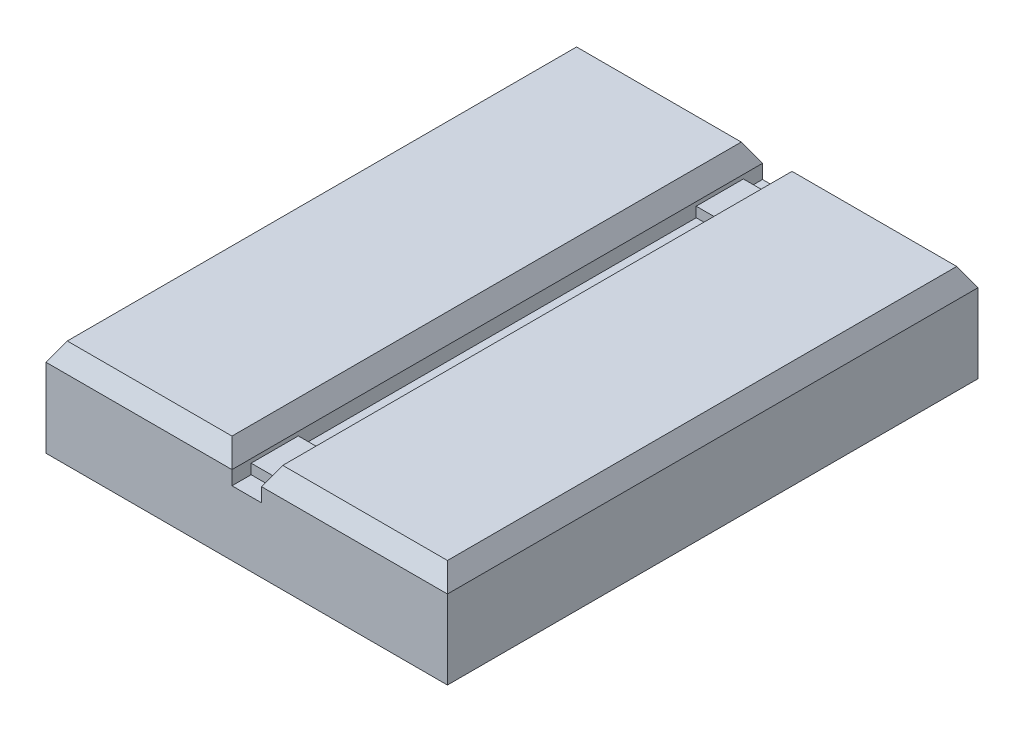
ISO-10303-21;
HEADER;
FILE_DESCRIPTION(('STEP AP214'),'2;1');
FILE_NAME('part.step','',(''),(''),'','','');
FILE_SCHEMA(('AUTOMOTIVE_DESIGN { 1 0 10303 214 1 1 1 1 }'));
ENDSEC;
DATA;
#1=APPLICATION_CONTEXT('core data for automotive mechanical design processes');
#2=APPLICATION_PROTOCOL_DEFINITION('international standard','automotive_design',2000,#1);
#3=PRODUCT_CONTEXT('',#1,'mechanical');
#4=PRODUCT('Part','Part','',(#3));
#5=PRODUCT_RELATED_PRODUCT_CATEGORY('part','',(#4));
#6=PRODUCT_DEFINITION_FORMATION('','',#4);
#7=PRODUCT_DEFINITION_CONTEXT('part definition',#1,'design');
#8=PRODUCT_DEFINITION('design','',#6,#7);
#9=PRODUCT_DEFINITION_SHAPE('','',#8);
#10=(LENGTH_UNIT() NAMED_UNIT(*) SI_UNIT(.MILLI.,.METRE.));
#11=(NAMED_UNIT(*) PLANE_ANGLE_UNIT() SI_UNIT($,.RADIAN.));
#12=(NAMED_UNIT(*) SI_UNIT($,.STERADIAN.) SOLID_ANGLE_UNIT());
#13=UNCERTAINTY_MEASURE_WITH_UNIT(LENGTH_MEASURE(1.E-05),#10,'distance_accuracy_value','');
#14=(GEOMETRIC_REPRESENTATION_CONTEXT(3) GLOBAL_UNCERTAINTY_ASSIGNED_CONTEXT((#13)) GLOBAL_UNIT_ASSIGNED_CONTEXT((#10,
#11,#12)) REPRESENTATION_CONTEXT('',''));
#15=CARTESIAN_POINT('',(0.,0.,0.));
#16=DIRECTION('',(0.,0.,1.));
#17=DIRECTION('',(1.,0.,0.));
#18=AXIS2_PLACEMENT_3D('',#15,#16,#17);
#19=CARTESIAN_POINT('',(1.27,8.382,22.86));
#20=DIRECTION('',(1.,0.,0.));
#21=DIRECTION('',(0.,1.,0.));
#22=AXIS2_PLACEMENT_3D('',#19,#20,#21);
#23=PLANE('',#22);
#24=DIRECTION('',(0.,1.,0.));
#25=VECTOR('',#24,1.);
#26=CARTESIAN_POINT('',(1.27,6.4516,-21.209));
#27=LINE('',#26,#25);
#28=CARTESIAN_POINT('',(1.27,5.588,-21.209));
#29=VERTEX_POINT('',#28);
#30=CARTESIAN_POINT('',(1.27,6.4516,-21.209));
#31=VERTEX_POINT('',#30);
#32=EDGE_CURVE('E189',#29,#31,#27,.T.);
#33=ORIENTED_EDGE('',*,*,#32,.T.);
#34=DIRECTION('',(0.,0.,1.));
#35=VECTOR('',#34,1.);
#36=CARTESIAN_POINT('',(1.27,6.4516,-21.209));
#37=LINE('',#36,#35);
#38=CARTESIAN_POINT('',(1.27,6.4516,-17.145));
#39=VERTEX_POINT('',#38);
#40=EDGE_CURVE('E188',#31,#39,#37,.T.);
#41=ORIENTED_EDGE('',*,*,#40,.T.);
#42=DIRECTION('',(0.,1.,0.));
#43=VECTOR('',#42,1.);
#44=CARTESIAN_POINT('',(1.27,6.4516,-17.145));
#45=LINE('',#44,#43);
#46=CARTESIAN_POINT('',(1.27,5.588,-17.145));
#47=VERTEX_POINT('',#46);
#48=EDGE_CURVE('E552',#47,#39,#45,.T.);
#49=ORIENTED_EDGE('',*,*,#48,.F.);
#50=DIRECTION('',(0.,0.,-1.));
#51=VECTOR('',#50,1.);
#52=CARTESIAN_POINT('',(1.27,5.588,22.86));
#53=LINE('',#52,#51);
#54=CARTESIAN_POINT('',(1.27,5.588,17.145));
#55=VERTEX_POINT('',#54);
#56=EDGE_CURVE('E266',#55,#47,#53,.T.);
#57=ORIENTED_EDGE('',*,*,#56,.F.);
#58=DIRECTION('',(0.,1.,0.));
#59=VECTOR('',#58,1.);
#60=CARTESIAN_POINT('',(1.27,6.4516,17.145));
#61=LINE('',#60,#59);
#62=CARTESIAN_POINT('',(1.27,6.4516,17.145));
#63=VERTEX_POINT('',#62);
#64=EDGE_CURVE('E210',#55,#63,#61,.T.);
#65=ORIENTED_EDGE('',*,*,#64,.T.);
#66=DIRECTION('',(0.,0.,-1.));
#67=VECTOR('',#66,1.);
#68=CARTESIAN_POINT('',(1.27,6.4516,21.209));
#69=LINE('',#68,#67);
#70=CARTESIAN_POINT('',(1.27,6.4516,21.209));
#71=VERTEX_POINT('',#70);
#72=EDGE_CURVE('E216',#71,#63,#69,.T.);
#73=ORIENTED_EDGE('',*,*,#72,.F.);
#74=DIRECTION('',(0.,1.,0.));
#75=VECTOR('',#74,1.);
#76=CARTESIAN_POINT('',(1.27,6.4516,21.209));
#77=LINE('',#76,#75);
#78=CARTESIAN_POINT('',(1.27,5.588,21.209));
#79=VERTEX_POINT('',#78);
#80=EDGE_CURVE('E204',#79,#71,#77,.T.);
#81=ORIENTED_EDGE('',*,*,#80,.F.);
#82=CARTESIAN_POINT('',(1.27,5.588,22.86));
#83=VERTEX_POINT('',#82);
#84=EDGE_CURVE('E262',#83,#79,#53,.T.);
#85=ORIENTED_EDGE('',*,*,#84,.F.);
#86=DIRECTION('',(0.,-1.,0.));
#87=VECTOR('',#86,1.);
#88=CARTESIAN_POINT('',(1.27,8.382,22.86));
#89=LINE('',#88,#87);
#90=CARTESIAN_POINT('',(1.27,6.79449999999999,22.86));
#91=VERTEX_POINT('',#90);
#92=EDGE_CURVE('E219',#91,#83,#89,.T.);
#93=ORIENTED_EDGE('',*,*,#92,.F.);
#94=DIRECTION('',(0.,0.,-1.));
#95=VECTOR('',#94,1.);
#96=CARTESIAN_POINT('',(1.27,6.79449999999999,22.86));
#97=LINE('',#96,#95);
#98=CARTESIAN_POINT('',(1.27,6.79449999999999,-22.86));
#99=VERTEX_POINT('',#98);
#100=EDGE_CURVE('E282',#91,#99,#97,.T.);
#101=ORIENTED_EDGE('',*,*,#100,.T.);
#102=DIRECTION('',(0.,-1.,0.));
#103=VECTOR('',#102,1.);
#104=CARTESIAN_POINT('',(1.27,8.382,-22.86));
#105=LINE('',#104,#103);
#106=CARTESIAN_POINT('',(1.27,5.588,-22.86));
#107=VERTEX_POINT('',#106);
#108=EDGE_CURVE('E235',#99,#107,#105,.T.);
#109=ORIENTED_EDGE('',*,*,#108,.T.);
#110=EDGE_CURVE('E260',#29,#107,#53,.T.);
#111=ORIENTED_EDGE('',*,*,#110,.F.);
#112=EDGE_LOOP('',(#33,#41,#49,#57,#65,#73,#81,#85,#93,#101,#109,#111));
#113=FACE_BOUND('',#112,.T.);
#114=ADVANCED_FACE('F32',(#113),#23,.F.);
#115=CARTESIAN_POINT('',(-1.27,8.382,22.86));
#116=DIRECTION('',(-1.,0.,0.));
#117=DIRECTION('',(0.,-1.,0.));
#118=AXIS2_PLACEMENT_3D('',#115,#116,#117);
#119=PLANE('',#118);
#120=DIRECTION('',(0.,-1.,0.));
#121=VECTOR('',#120,1.);
#122=CARTESIAN_POINT('',(-1.27,5.588,-21.209));
#123=LINE('',#122,#121);
#124=CARTESIAN_POINT('',(-1.27,6.4516,-21.209));
#125=VERTEX_POINT('',#124);
#126=CARTESIAN_POINT('',(-1.27,5.588,-21.209));
#127=VERTEX_POINT('',#126);
#128=EDGE_CURVE('E172',#125,#127,#123,.T.);
#129=ORIENTED_EDGE('',*,*,#128,.T.);
#130=DIRECTION('',(0.,0.,-1.));
#131=VECTOR('',#130,1.);
#132=CARTESIAN_POINT('',(-1.27,5.588,22.86));
#133=LINE('',#132,#131);
#134=CARTESIAN_POINT('',(-1.27,5.588,-22.86));
#135=VERTEX_POINT('',#134);
#136=EDGE_CURVE('E256',#127,#135,#133,.T.);
#137=ORIENTED_EDGE('',*,*,#136,.T.);
#138=DIRECTION('',(0.,1.,0.));
#139=VECTOR('',#138,1.);
#140=CARTESIAN_POINT('',(-1.27,8.382,-22.86));
#141=LINE('',#140,#139);
#142=CARTESIAN_POINT('',(-1.27,6.79449999999999,-22.86));
#143=VERTEX_POINT('',#142);
#144=EDGE_CURVE('E242',#135,#143,#141,.T.);
#145=ORIENTED_EDGE('',*,*,#144,.T.);
#146=DIRECTION('',(0.,0.,1.));
#147=VECTOR('',#146,1.);
#148=CARTESIAN_POINT('',(-1.27,6.79449999999999,22.86));
#149=LINE('',#148,#147);
#150=CARTESIAN_POINT('',(-1.27,6.79449999999999,22.86));
#151=VERTEX_POINT('',#150);
#152=EDGE_CURVE('E41',#143,#151,#149,.T.);
#153=ORIENTED_EDGE('',*,*,#152,.T.);
#154=DIRECTION('',(0.,1.,0.));
#155=VECTOR('',#154,1.);
#156=CARTESIAN_POINT('',(-1.27,8.382,22.86));
#157=LINE('',#156,#155);
#158=CARTESIAN_POINT('',(-1.27,5.588,22.86));
#159=VERTEX_POINT('',#158);
#160=EDGE_CURVE('E224',#159,#151,#157,.T.);
#161=ORIENTED_EDGE('',*,*,#160,.F.);
#162=CARTESIAN_POINT('',(-1.27,5.588,21.209));
#163=VERTEX_POINT('',#162);
#164=EDGE_CURVE('E257',#159,#163,#133,.T.);
#165=ORIENTED_EDGE('',*,*,#164,.T.);
#166=DIRECTION('',(0.,-1.,0.));
#167=VECTOR('',#166,1.);
#168=CARTESIAN_POINT('',(-1.27,5.588,21.209));
#169=LINE('',#168,#167);
#170=CARTESIAN_POINT('',(-1.27,6.4516,21.209));
#171=VERTEX_POINT('',#170);
#172=EDGE_CURVE('E199',#171,#163,#169,.T.);
#173=ORIENTED_EDGE('',*,*,#172,.F.);
#174=DIRECTION('',(0.,0.,-1.));
#175=VECTOR('',#174,1.);
#176=CARTESIAN_POINT('',(-1.27,6.4516,21.209));
#177=LINE('',#176,#175);
#178=CARTESIAN_POINT('',(-1.27,6.4516,17.145));
#179=VERTEX_POINT('',#178);
#180=EDGE_CURVE('E207',#171,#179,#177,.T.);
#181=ORIENTED_EDGE('',*,*,#180,.T.);
#182=DIRECTION('',(0.,-1.,0.));
#183=VECTOR('',#182,1.);
#184=CARTESIAN_POINT('',(-1.27,5.588,17.145));
#185=LINE('',#184,#183);
#186=CARTESIAN_POINT('',(-1.27,5.588,17.145));
#187=VERTEX_POINT('',#186);
#188=EDGE_CURVE('E193',#179,#187,#185,.T.);
#189=ORIENTED_EDGE('',*,*,#188,.T.);
#190=CARTESIAN_POINT('',(-1.27,5.588,-17.145));
#191=VERTEX_POINT('',#190);
#192=EDGE_CURVE('E261',#187,#191,#133,.T.);
#193=ORIENTED_EDGE('',*,*,#192,.T.);
#194=DIRECTION('',(0.,-1.,0.));
#195=VECTOR('',#194,1.);
#196=CARTESIAN_POINT('',(-1.27,5.588,-17.145));
#197=LINE('',#196,#195);
#198=CARTESIAN_POINT('',(-1.27,6.4516,-17.145));
#199=VERTEX_POINT('',#198);
#200=EDGE_CURVE('E49',#199,#191,#197,.T.);
#201=ORIENTED_EDGE('',*,*,#200,.F.);
#202=DIRECTION('',(0.,0.,1.));
#203=VECTOR('',#202,1.);
#204=CARTESIAN_POINT('',(-1.27,6.4516,-21.209));
#205=LINE('',#204,#203);
#206=EDGE_CURVE('E186',#125,#199,#205,.T.);
#207=ORIENTED_EDGE('',*,*,#206,.F.);
#208=EDGE_LOOP('',(#129,#137,#145,#153,#161,#165,#173,#181,#189,#193,#201,#207));
#209=FACE_BOUND('',#208,.T.);
#210=ADVANCED_FACE('F191',(#209),#119,.F.);
#211=CARTESIAN_POINT('',(1.27,5.588,22.86));
#212=DIRECTION('',(0.,-1.,0.));
#213=DIRECTION('',(0.,0.,-1.));
#214=AXIS2_PLACEMENT_3D('',#211,#212,#213);
#215=PLANE('',#214);
#216=DIRECTION('',(1.,0.,0.));
#217=VECTOR('',#216,1.);
#218=CARTESIAN_POINT('',(1.27,5.588,-21.209));
#219=LINE('',#218,#217);
#220=EDGE_CURVE('E178',#127,#29,#219,.T.);
#221=ORIENTED_EDGE('',*,*,#220,.T.);
#222=ORIENTED_EDGE('',*,*,#110,.T.);
#223=DIRECTION('',(-1.,0.,0.));
#224=VECTOR('',#223,1.);
#225=CARTESIAN_POINT('',(1.27,5.588,-22.86));
#226=LINE('',#225,#224);
#227=EDGE_CURVE('E238',#107,#135,#226,.T.);
#228=ORIENTED_EDGE('',*,*,#227,.T.);
#229=ORIENTED_EDGE('',*,*,#136,.F.);
#230=EDGE_LOOP('',(#221,#222,#228,#229));
#231=FACE_BOUND('',#230,.T.);
#232=ADVANCED_FACE('F372',(#231),#215,.F.);
#233=DIRECTION('',(1.,0.,0.));
#234=VECTOR('',#233,1.);
#235=CARTESIAN_POINT('',(1.27,5.588,21.209));
#236=LINE('',#235,#234);
#237=EDGE_CURVE('E201',#163,#79,#236,.T.);
#238=ORIENTED_EDGE('',*,*,#237,.F.);
#239=ORIENTED_EDGE('',*,*,#164,.F.);
#240=DIRECTION('',(-1.,0.,0.));
#241=VECTOR('',#240,1.);
#242=CARTESIAN_POINT('',(1.27,5.588,22.86));
#243=LINE('',#242,#241);
#244=EDGE_CURVE('E221',#83,#159,#243,.T.);
#245=ORIENTED_EDGE('',*,*,#244,.F.);
#246=ORIENTED_EDGE('',*,*,#84,.T.);
#247=EDGE_LOOP('',(#238,#239,#245,#246));
#248=FACE_BOUND('',#247,.T.);
#249=ADVANCED_FACE('F373',(#248),#215,.F.);
#250=CARTESIAN_POINT('',(1.27,8.382,22.86));
#251=DIRECTION('',(0.,-1.,0.));
#252=DIRECTION('',(0.,0.,-1.));
#253=AXIS2_PLACEMENT_3D('',#250,#251,#252);
#254=PLANE('',#253);
#255=DIRECTION('',(1.,0.,0.));
#256=VECTOR('',#255,1.);
#257=CARTESIAN_POINT('',(17.2974,8.382,21.9434564476615));
#258=LINE('',#257,#256);
#259=CARTESIAN_POINT('',(2.18654355233853,8.382,21.9434564476615));
#260=VERTEX_POINT('',#259);
#261=CARTESIAN_POINT('',(16.3808564476615,8.382,21.9434564476615));
#262=VERTEX_POINT('',#261);
#263=EDGE_CURVE('E270',#260,#262,#258,.T.);
#264=ORIENTED_EDGE('',*,*,#263,.T.);
#265=DIRECTION('',(0.,0.,-1.));
#266=VECTOR('',#265,1.);
#267=CARTESIAN_POINT('',(16.3808564476615,8.382,22.86));
#268=LINE('',#267,#266);
#269=CARTESIAN_POINT('',(16.3808564476615,8.382,-21.9434564476615));
#270=VERTEX_POINT('',#269);
#271=EDGE_CURVE('E272',#262,#270,#268,.T.);
#272=ORIENTED_EDGE('',*,*,#271,.T.);
#273=DIRECTION('',(-1.,0.,0.));
#274=VECTOR('',#273,1.);
#275=CARTESIAN_POINT('',(1.27,8.382,-21.9434564476615));
#276=LINE('',#275,#274);
#277=CARTESIAN_POINT('',(2.18654355233853,8.382,-21.9434564476615));
#278=VERTEX_POINT('',#277);
#279=EDGE_CURVE('E265',#270,#278,#276,.T.);
#280=ORIENTED_EDGE('',*,*,#279,.T.);
#281=DIRECTION('',(0.,0.,1.));
#282=VECTOR('',#281,1.);
#283=CARTESIAN_POINT('',(2.18654355233853,8.382,22.86));
#284=LINE('',#283,#282);
#285=EDGE_CURVE('E268',#278,#260,#284,.T.);
#286=ORIENTED_EDGE('',*,*,#285,.T.);
#287=EDGE_LOOP('',(#264,#272,#280,#286));
#288=FACE_BOUND('',#287,.T.);
#289=ADVANCED_FACE('F369',(#288),#254,.F.);
#290=ORIENTED_EDGE('',*,*,#56,.T.);
#291=DIRECTION('',(1.,0.,0.));
#292=VECTOR('',#291,1.);
#293=CARTESIAN_POINT('',(1.27,5.588,-17.145));
#294=LINE('',#293,#292);
#295=EDGE_CURVE('E182',#191,#47,#294,.T.);
#296=ORIENTED_EDGE('',*,*,#295,.F.);
#297=ORIENTED_EDGE('',*,*,#192,.F.);
#298=DIRECTION('',(1.,0.,0.));
#299=VECTOR('',#298,1.);
#300=CARTESIAN_POINT('',(1.27,5.588,17.145));
#301=LINE('',#300,#299);
#302=EDGE_CURVE('E57',#187,#55,#301,.T.);
#303=ORIENTED_EDGE('',*,*,#302,.T.);
#304=EDGE_LOOP('',(#290,#296,#297,#303));
#305=FACE_BOUND('',#304,.T.);
#306=ADVANCED_FACE('F362',(#305),#215,.F.);
#307=CARTESIAN_POINT('',(-1.27,8.382,22.86));
#308=DIRECTION('',(0.,-1.,0.));
#309=DIRECTION('',(0.,0.,-1.));
#310=AXIS2_PLACEMENT_3D('',#307,#308,#309);
#311=PLANE('',#310);
#312=DIRECTION('',(1.,0.,0.));
#313=VECTOR('',#312,1.);
#314=CARTESIAN_POINT('',(-1.27,8.382,21.9434564476615));
#315=LINE('',#314,#313);
#316=CARTESIAN_POINT('',(-16.3808564476615,8.382,21.9434564476615));
#317=VERTEX_POINT('',#316);
#318=CARTESIAN_POINT('',(-2.18654355233853,8.382,21.9434564476615));
#319=VERTEX_POINT('',#318);
#320=EDGE_CURVE('E292',#317,#319,#315,.T.);
#321=ORIENTED_EDGE('',*,*,#320,.T.);
#322=DIRECTION('',(0.,0.,-1.));
#323=VECTOR('',#322,1.);
#324=CARTESIAN_POINT('',(-2.18654355233853,8.382,22.86));
#325=LINE('',#324,#323);
#326=CARTESIAN_POINT('',(-2.18654355233853,8.382,-21.9434564476615));
#327=VERTEX_POINT('',#326);
#328=EDGE_CURVE('E294',#319,#327,#325,.T.);
#329=ORIENTED_EDGE('',*,*,#328,.T.);
#330=DIRECTION('',(-1.,0.,0.));
#331=VECTOR('',#330,1.);
#332=CARTESIAN_POINT('',(-1.27,8.382,-21.9434564476615));
#333=LINE('',#332,#331);
#334=CARTESIAN_POINT('',(-16.3808564476615,8.382,-21.9434564476615));
#335=VERTEX_POINT('',#334);
#336=EDGE_CURVE('E288',#327,#335,#333,.T.);
#337=ORIENTED_EDGE('',*,*,#336,.T.);
#338=DIRECTION('',(0.,0.,1.));
#339=VECTOR('',#338,1.);
#340=CARTESIAN_POINT('',(-16.3808564476615,8.382,22.86));
#341=LINE('',#340,#339);
#342=EDGE_CURVE('E290',#335,#317,#341,.T.);
#343=ORIENTED_EDGE('',*,*,#342,.T.);
#344=EDGE_LOOP('',(#321,#329,#337,#343));
#345=FACE_BOUND('',#344,.T.);
#346=ADVANCED_FACE('F360',(#345),#311,.F.);
#347=CARTESIAN_POINT('',(-17.2974,0.,22.86));
#348=DIRECTION('',(1.,0.,0.));
#349=DIRECTION('',(0.,0.,-1.));
#350=AXIS2_PLACEMENT_3D('',#347,#348,#349);
#351=PLANE('',#350);
#352=DIRECTION('',(0.,-1.,0.));
#353=VECTOR('',#352,1.);
#354=CARTESIAN_POINT('',(-17.2974,0.,22.86));
#355=LINE('',#354,#353);
#356=CARTESIAN_POINT('',(-17.2974,6.79449999999999,22.86));
#357=VERTEX_POINT('',#356);
#358=CARTESIAN_POINT('',(-17.2974,0.,22.86));
#359=VERTEX_POINT('',#358);
#360=EDGE_CURVE('E227',#357,#359,#355,.T.);
#361=ORIENTED_EDGE('',*,*,#360,.F.);
#362=DIRECTION('',(0.,0.,-1.));
#363=VECTOR('',#362,1.);
#364=CARTESIAN_POINT('',(-17.2974,6.79449999999999,22.86));
#365=LINE('',#364,#363);
#366=CARTESIAN_POINT('',(-17.2974,6.79449999999999,-22.86));
#367=VERTEX_POINT('',#366);
#368=EDGE_CURVE('E11',#357,#367,#365,.T.);
#369=ORIENTED_EDGE('',*,*,#368,.T.);
#370=DIRECTION('',(0.,-1.,0.));
#371=VECTOR('',#370,1.);
#372=CARTESIAN_POINT('',(-17.2974,0.,-22.86));
#373=LINE('',#372,#371);
#374=CARTESIAN_POINT('',(-17.2974,0.,-22.86));
#375=VERTEX_POINT('',#374);
#376=EDGE_CURVE('E245',#367,#375,#373,.T.);
#377=ORIENTED_EDGE('',*,*,#376,.T.);
#378=DIRECTION('',(0.,0.,-1.));
#379=VECTOR('',#378,1.);
#380=CARTESIAN_POINT('',(-17.2974,0.,22.86));
#381=LINE('',#380,#379);
#382=EDGE_CURVE('E253',#359,#375,#381,.T.);
#383=ORIENTED_EDGE('',*,*,#382,.F.);
#384=EDGE_LOOP('',(#361,#369,#377,#383));
#385=FACE_BOUND('',#384,.T.);
#386=ADVANCED_FACE('F329',(#385),#351,.F.);
#387=CARTESIAN_POINT('',(-17.2974,0.,22.86));
#388=DIRECTION('',(0.,1.,0.));
#389=DIRECTION('',(0.,0.,1.));
#390=AXIS2_PLACEMENT_3D('',#387,#388,#389);
#391=PLANE('',#390);
#392=DIRECTION('',(1.,0.,0.));
#393=VECTOR('',#392,1.);
#394=CARTESIAN_POINT('',(-17.2974,0.,-22.86));
#395=LINE('',#394,#393);
#396=CARTESIAN_POINT('',(17.2974,0.,-22.86));
#397=VERTEX_POINT('',#396);
#398=EDGE_CURVE('E247',#375,#397,#395,.T.);
#399=ORIENTED_EDGE('',*,*,#398,.T.);
#400=DIRECTION('',(0.,0.,-1.));
#401=VECTOR('',#400,1.);
#402=CARTESIAN_POINT('',(17.2974,0.,22.86));
#403=LINE('',#402,#401);
#404=CARTESIAN_POINT('',(17.2974,0.,22.86));
#405=VERTEX_POINT('',#404);
#406=EDGE_CURVE('E234',#405,#397,#403,.T.);
#407=ORIENTED_EDGE('',*,*,#406,.F.);
#408=DIRECTION('',(1.,0.,0.));
#409=VECTOR('',#408,1.);
#410=CARTESIAN_POINT('',(-17.2974,0.,22.86));
#411=LINE('',#410,#409);
#412=EDGE_CURVE('E229',#359,#405,#411,.T.);
#413=ORIENTED_EDGE('',*,*,#412,.F.);
#414=ORIENTED_EDGE('',*,*,#382,.T.);
#415=EDGE_LOOP('',(#399,#407,#413,#414));
#416=FACE_BOUND('',#415,.T.);
#417=ADVANCED_FACE('F339',(#416),#391,.F.);
#418=CARTESIAN_POINT('',(17.2974,0.,22.86));
#419=DIRECTION('',(-1.,0.,0.));
#420=DIRECTION('',(0.,0.,1.));
#421=AXIS2_PLACEMENT_3D('',#418,#419,#420);
#422=PLANE('',#421);
#423=DIRECTION('',(0.,1.,0.));
#424=VECTOR('',#423,1.);
#425=CARTESIAN_POINT('',(17.2974,0.,-22.86));
#426=LINE('',#425,#424);
#427=CARTESIAN_POINT('',(17.2974,6.79449999999999,-22.86));
#428=VERTEX_POINT('',#427);
#429=EDGE_CURVE('E222',#397,#428,#426,.T.);
#430=ORIENTED_EDGE('',*,*,#429,.T.);
#431=DIRECTION('',(0.,0.,1.));
#432=VECTOR('',#431,1.);
#433=CARTESIAN_POINT('',(17.2974,6.79449999999999,22.86));
#434=LINE('',#433,#432);
#435=CARTESIAN_POINT('',(17.2974,6.79449999999999,22.86));
#436=VERTEX_POINT('',#435);
#437=EDGE_CURVE('E275',#428,#436,#434,.T.);
#438=ORIENTED_EDGE('',*,*,#437,.T.);
#439=DIRECTION('',(0.,1.,0.));
#440=VECTOR('',#439,1.);
#441=CARTESIAN_POINT('',(17.2974,0.,22.86));
#442=LINE('',#441,#440);
#443=EDGE_CURVE('E231',#405,#436,#442,.T.);
#444=ORIENTED_EDGE('',*,*,#443,.F.);
#445=ORIENTED_EDGE('',*,*,#406,.T.);
#446=EDGE_LOOP('',(#430,#438,#444,#445));
#447=FACE_BOUND('',#446,.T.);
#448=ADVANCED_FACE('F343',(#447),#422,.F.);
#449=CARTESIAN_POINT('',(0.,0.,22.86));
#450=DIRECTION('',(0.,0.,1.));
#451=DIRECTION('',(1.,0.,0.));
#452=AXIS2_PLACEMENT_3D('',#449,#450,#451);
#453=PLANE('',#452);
#454=ORIENTED_EDGE('',*,*,#443,.T.);
#455=DIRECTION('',(-1.,0.,0.));
#456=VECTOR('',#455,1.);
#457=CARTESIAN_POINT('',(1.27,6.79449999999999,22.86));
#458=LINE('',#457,#456);
#459=EDGE_CURVE('E280',#436,#91,#458,.T.);
#460=ORIENTED_EDGE('',*,*,#459,.T.);
#461=ORIENTED_EDGE('',*,*,#92,.T.);
#462=ORIENTED_EDGE('',*,*,#244,.T.);
#463=ORIENTED_EDGE('',*,*,#160,.T.);
#464=DIRECTION('',(-1.,0.,0.));
#465=VECTOR('',#464,1.);
#466=CARTESIAN_POINT('',(-17.2974,6.79449999999999,22.86));
#467=LINE('',#466,#465);
#468=EDGE_CURVE('E278',#151,#357,#467,.T.);
#469=ORIENTED_EDGE('',*,*,#468,.T.);
#470=ORIENTED_EDGE('',*,*,#360,.T.);
#471=ORIENTED_EDGE('',*,*,#412,.T.);
#472=EDGE_LOOP('',(#454,#460,#461,#462,#463,#469,#470,#471));
#473=FACE_BOUND('',#472,.T.);
#474=ADVANCED_FACE('F346',(#473),#453,.T.);
#475=CARTESIAN_POINT('',(0.,0.,-22.86));
#476=DIRECTION('',(0.,0.,1.));
#477=DIRECTION('',(1.,0.,0.));
#478=AXIS2_PLACEMENT_3D('',#475,#476,#477);
#479=PLANE('',#478);
#480=ORIENTED_EDGE('',*,*,#108,.F.);
#481=DIRECTION('',(1.,0.,0.));
#482=VECTOR('',#481,1.);
#483=CARTESIAN_POINT('',(0.,6.79449999999999,-22.86));
#484=LINE('',#483,#482);
#485=EDGE_CURVE('E286',#99,#428,#484,.T.);
#486=ORIENTED_EDGE('',*,*,#485,.T.);
#487=ORIENTED_EDGE('',*,*,#429,.F.);
#488=ORIENTED_EDGE('',*,*,#398,.F.);
#489=ORIENTED_EDGE('',*,*,#376,.F.);
#490=DIRECTION('',(1.,0.,0.));
#491=VECTOR('',#490,1.);
#492=CARTESIAN_POINT('',(0.,6.79449999999999,-22.86));
#493=LINE('',#492,#491);
#494=EDGE_CURVE('E284',#367,#143,#493,.T.);
#495=ORIENTED_EDGE('',*,*,#494,.T.);
#496=ORIENTED_EDGE('',*,*,#144,.F.);
#497=ORIENTED_EDGE('',*,*,#227,.F.);
#498=EDGE_LOOP('',(#480,#486,#487,#488,#489,#495,#496,#497));
#499=FACE_BOUND('',#498,.T.);
#500=ADVANCED_FACE('F334',(#499),#479,.F.);
#501=CARTESIAN_POINT('',(1.27,6.79449999999999,22.86));
#502=DIRECTION('',(0.86602540378444,-0.499999999999997,0.));
#503=DIRECTION('',(0.,0.,-1.));
#504=AXIS2_PLACEMENT_3D('',#501,#502,#503);
#505=PLANE('',#504);
#506=DIRECTION('',(0.447213595499956,0.774596669241486,0.447213595499955));
#507=VECTOR('',#506,1.);
#508=CARTESIAN_POINT('',(2.00323484187083,8.0645,-22.1267651581292));
#509=LINE('',#508,#507);
#510=EDGE_CURVE('E303',#99,#278,#509,.T.);
#511=ORIENTED_EDGE('',*,*,#510,.F.);
#512=ORIENTED_EDGE('',*,*,#100,.F.);
#513=DIRECTION('',(-0.447213595499956,-0.774596669241486,0.447213595499956));
#514=VECTOR('',#513,1.);
#515=CARTESIAN_POINT('',(1.27,6.79449999999999,22.86));
#516=LINE('',#515,#514);
#517=EDGE_CURVE('E239',#260,#91,#516,.T.);
#518=ORIENTED_EDGE('',*,*,#517,.F.);
#519=ORIENTED_EDGE('',*,*,#285,.F.);
#520=EDGE_LOOP('',(#511,#512,#518,#519));
#521=FACE_BOUND('',#520,.T.);
#522=ADVANCED_FACE('F396',(#521),#505,.F.);
#523=CARTESIAN_POINT('',(0.,6.79449999999999,22.86));
#524=DIRECTION('',(0.,0.499999999999997,0.86602540378444));
#525=DIRECTION('',(1.,0.,0.));
#526=AXIS2_PLACEMENT_3D('',#523,#524,#525);
#527=PLANE('',#526);
#528=ORIENTED_EDGE('',*,*,#517,.T.);
#529=ORIENTED_EDGE('',*,*,#459,.F.);
#530=DIRECTION('',(0.447213595499956,-0.774596669241486,0.447213595499956));
#531=VECTOR('',#530,1.);
#532=CARTESIAN_POINT('',(13.83792,12.7864951277684,19.40052));
#533=LINE('',#532,#531);
#534=EDGE_CURVE('E301',#262,#436,#533,.T.);
#535=ORIENTED_EDGE('',*,*,#534,.F.);
#536=ORIENTED_EDGE('',*,*,#263,.F.);
#537=EDGE_LOOP('',(#528,#529,#535,#536));
#538=FACE_BOUND('',#537,.T.);
#539=ADVANCED_FACE('F392',(#538),#527,.T.);
#540=CARTESIAN_POINT('',(1.27,8.382,-21.9434564476615));
#541=DIRECTION('',(0.,-0.499999999999996,0.866025403784441));
#542=DIRECTION('',(-1.,0.,0.));
#543=AXIS2_PLACEMENT_3D('',#540,#541,#542);
#544=PLANE('',#543);
#545=ORIENTED_EDGE('',*,*,#510,.T.);
#546=ORIENTED_EDGE('',*,*,#279,.F.);
#547=DIRECTION('',(0.447213595499956,-0.774596669241486,-0.447213595499955));
#548=VECTOR('',#547,1.);
#549=CARTESIAN_POINT('',(13.3586851581292,13.6165542226459,-18.9212851581292));
#550=LINE('',#549,#548);
#551=EDGE_CURVE('E299',#428,#270,#550,.F.);
#552=ORIENTED_EDGE('',*,*,#551,.F.);
#553=ORIENTED_EDGE('',*,*,#485,.F.);
#554=EDGE_LOOP('',(#545,#546,#552,#553));
#555=FACE_BOUND('',#554,.T.);
#556=ADVANCED_FACE('F388',(#555),#544,.F.);
#557=CARTESIAN_POINT('',(16.3808564476615,8.382,22.86));
#558=DIRECTION('',(-0.86602540378444,-0.499999999999997,0.));
#559=DIRECTION('',(0.,0.,-1.));
#560=AXIS2_PLACEMENT_3D('',#557,#558,#559);
#561=PLANE('',#560);
#562=ORIENTED_EDGE('',*,*,#534,.T.);
#563=ORIENTED_EDGE('',*,*,#437,.F.);
#564=ORIENTED_EDGE('',*,*,#551,.T.);
#565=ORIENTED_EDGE('',*,*,#271,.F.);
#566=EDGE_LOOP('',(#562,#563,#564,#565));
#567=FACE_BOUND('',#566,.T.);
#568=ADVANCED_FACE('F385',(#567),#561,.F.);
#569=CARTESIAN_POINT('',(-17.2974,6.79449999999999,22.86));
#570=DIRECTION('',(0.86602540378444,-0.499999999999997,0.));
#571=DIRECTION('',(0.,0.,-1.));
#572=AXIS2_PLACEMENT_3D('',#569,#570,#571);
#573=PLANE('',#572);
#574=DIRECTION('',(0.447213595499956,0.774596669241486,0.447213595499955));
#575=VECTOR('',#574,1.);
#576=CARTESIAN_POINT('',(-13.3586851581292,13.6165542226459,-18.9212851581292));
#577=LINE('',#576,#575);
#578=EDGE_CURVE('E310',#367,#335,#577,.T.);
#579=ORIENTED_EDGE('',*,*,#578,.F.);
#580=ORIENTED_EDGE('',*,*,#368,.F.);
#581=DIRECTION('',(-0.447213595499956,-0.774596669241486,0.447213595499956));
#582=VECTOR('',#581,1.);
#583=CARTESIAN_POINT('',(-17.2974,6.79449999999999,22.86));
#584=LINE('',#583,#582);
#585=EDGE_CURVE('E36',#317,#357,#584,.T.);
#586=ORIENTED_EDGE('',*,*,#585,.F.);
#587=ORIENTED_EDGE('',*,*,#342,.F.);
#588=EDGE_LOOP('',(#579,#580,#586,#587));
#589=FACE_BOUND('',#588,.T.);
#590=ADVANCED_FACE('F34',(#589),#573,.F.);
#591=CARTESIAN_POINT('',(0.,6.79449999999999,22.86));
#592=DIRECTION('',(0.,0.499999999999997,0.86602540378444));
#593=DIRECTION('',(1.,0.,0.));
#594=AXIS2_PLACEMENT_3D('',#591,#592,#593);
#595=PLANE('',#594);
#596=ORIENTED_EDGE('',*,*,#585,.T.);
#597=ORIENTED_EDGE('',*,*,#468,.F.);
#598=DIRECTION('',(0.447213595499956,-0.774596669241486,0.447213595499956));
#599=VECTOR('',#598,1.);
#600=CARTESIAN_POINT('',(-1.016,6.35455909487749,23.114));
#601=LINE('',#600,#599);
#602=EDGE_CURVE('E309',#319,#151,#601,.T.);
#603=ORIENTED_EDGE('',*,*,#602,.F.);
#604=ORIENTED_EDGE('',*,*,#320,.F.);
#605=EDGE_LOOP('',(#596,#597,#603,#604));
#606=FACE_BOUND('',#605,.T.);
#607=ADVANCED_FACE('F321',(#606),#595,.T.);
#608=CARTESIAN_POINT('',(-1.27,8.382,-21.9434564476615));
#609=DIRECTION('',(0.,-0.499999999999996,0.866025403784441));
#610=DIRECTION('',(-1.,0.,0.));
#611=AXIS2_PLACEMENT_3D('',#608,#609,#610);
#612=PLANE('',#611);
#613=ORIENTED_EDGE('',*,*,#578,.T.);
#614=ORIENTED_EDGE('',*,*,#336,.F.);
#615=DIRECTION('',(0.447213595499956,-0.774596669241486,-0.447213595499955));
#616=VECTOR('',#615,1.);
#617=CARTESIAN_POINT('',(-2.00323484187083,8.0645,-22.1267651581292));
#618=LINE('',#617,#616);
#619=EDGE_CURVE('E218',#143,#327,#618,.F.);
#620=ORIENTED_EDGE('',*,*,#619,.F.);
#621=ORIENTED_EDGE('',*,*,#494,.F.);
#622=EDGE_LOOP('',(#613,#614,#620,#621));
#623=FACE_BOUND('',#622,.T.);
#624=ADVANCED_FACE('F358',(#623),#612,.F.);
#625=CARTESIAN_POINT('',(-2.18654355233853,8.382,22.86));
#626=DIRECTION('',(-0.86602540378444,-0.499999999999997,0.));
#627=DIRECTION('',(0.,0.,-1.));
#628=AXIS2_PLACEMENT_3D('',#625,#626,#627);
#629=PLANE('',#628);
#630=ORIENTED_EDGE('',*,*,#602,.T.);
#631=ORIENTED_EDGE('',*,*,#152,.F.);
#632=ORIENTED_EDGE('',*,*,#619,.T.);
#633=ORIENTED_EDGE('',*,*,#328,.F.);
#634=EDGE_LOOP('',(#630,#631,#632,#633));
#635=FACE_BOUND('',#634,.T.);
#636=ADVANCED_FACE('F356',(#635),#629,.F.);
#637=CARTESIAN_POINT('',(-1.27,6.4516,21.209));
#638=DIRECTION('',(0.,-1.,0.));
#639=DIRECTION('',(0.,0.,-1.));
#640=AXIS2_PLACEMENT_3D('',#637,#638,#639);
#641=PLANE('',#640);
#642=DIRECTION('',(-1.,0.,0.));
#643=VECTOR('',#642,1.);
#644=CARTESIAN_POINT('',(-1.27,6.4516,17.145));
#645=LINE('',#644,#643);
#646=EDGE_CURVE('E202',#63,#179,#645,.T.);
#647=ORIENTED_EDGE('',*,*,#646,.T.);
#648=ORIENTED_EDGE('',*,*,#180,.F.);
#649=DIRECTION('',(-1.,0.,0.));
#650=VECTOR('',#649,1.);
#651=CARTESIAN_POINT('',(-1.27,6.4516,21.209));
#652=LINE('',#651,#650);
#653=EDGE_CURVE('E206',#71,#171,#652,.T.);
#654=ORIENTED_EDGE('',*,*,#653,.F.);
#655=ORIENTED_EDGE('',*,*,#72,.T.);
#656=EDGE_LOOP('',(#647,#648,#654,#655));
#657=FACE_BOUND('',#656,.T.);
#658=ADVANCED_FACE('F403',(#657),#641,.F.);
#659=CARTESIAN_POINT('',(0.,0.,21.209));
#660=DIRECTION('',(0.,0.,-1.));
#661=DIRECTION('',(-1.,0.,0.));
#662=AXIS2_PLACEMENT_3D('',#659,#660,#661);
#663=PLANE('',#662);
#664=ORIENTED_EDGE('',*,*,#172,.T.);
#665=ORIENTED_EDGE('',*,*,#237,.T.);
#666=ORIENTED_EDGE('',*,*,#80,.T.);
#667=ORIENTED_EDGE('',*,*,#653,.T.);
#668=EDGE_LOOP('',(#664,#665,#666,#667));
#669=FACE_BOUND('',#668,.T.);
#670=ADVANCED_FACE('F512',(#669),#663,.F.);
#671=CARTESIAN_POINT('',(0.,0.,17.145));
#672=DIRECTION('',(0.,0.,-1.));
#673=DIRECTION('',(-1.,0.,0.));
#674=AXIS2_PLACEMENT_3D('',#671,#672,#673);
#675=PLANE('',#674);
#676=ORIENTED_EDGE('',*,*,#188,.F.);
#677=ORIENTED_EDGE('',*,*,#646,.F.);
#678=ORIENTED_EDGE('',*,*,#64,.F.);
#679=ORIENTED_EDGE('',*,*,#302,.F.);
#680=EDGE_LOOP('',(#676,#677,#678,#679));
#681=FACE_BOUND('',#680,.T.);
#682=ADVANCED_FACE('F488',(#681),#675,.T.);
#683=CARTESIAN_POINT('',(-1.27,6.4516,-21.209));
#684=DIRECTION('',(0.,1.,0.));
#685=DIRECTION('',(0.,0.,1.));
#686=AXIS2_PLACEMENT_3D('',#683,#684,#685);
#687=PLANE('',#686);
#688=DIRECTION('',(-1.,0.,0.));
#689=VECTOR('',#688,1.);
#690=CARTESIAN_POINT('',(-1.27,6.4516,-17.145));
#691=LINE('',#690,#689);
#692=EDGE_CURVE('E550',#39,#199,#691,.T.);
#693=ORIENTED_EDGE('',*,*,#692,.F.);
#694=ORIENTED_EDGE('',*,*,#40,.F.);
#695=DIRECTION('',(-1.,0.,0.));
#696=VECTOR('',#695,1.);
#697=CARTESIAN_POINT('',(-1.27,6.4516,-21.209));
#698=LINE('',#697,#696);
#699=EDGE_CURVE('E175',#31,#125,#698,.T.);
#700=ORIENTED_EDGE('',*,*,#699,.T.);
#701=ORIENTED_EDGE('',*,*,#206,.T.);
#702=EDGE_LOOP('',(#693,#694,#700,#701));
#703=FACE_BOUND('',#702,.T.);
#704=ADVANCED_FACE('F185',(#703),#687,.T.);
#705=CARTESIAN_POINT('',(0.,0.,-21.209));
#706=DIRECTION('',(0.,0.,1.));
#707=DIRECTION('',(-1.,0.,0.));
#708=AXIS2_PLACEMENT_3D('',#705,#706,#707);
#709=PLANE('',#708);
#710=ORIENTED_EDGE('',*,*,#128,.F.);
#711=ORIENTED_EDGE('',*,*,#699,.F.);
#712=ORIENTED_EDGE('',*,*,#32,.F.);
#713=ORIENTED_EDGE('',*,*,#220,.F.);
#714=EDGE_LOOP('',(#710,#711,#712,#713));
#715=FACE_BOUND('',#714,.T.);
#716=ADVANCED_FACE('F174',(#715),#709,.F.);
#717=CARTESIAN_POINT('',(0.,0.,-17.145));
#718=DIRECTION('',(0.,0.,1.));
#719=DIRECTION('',(-1.,0.,0.));
#720=AXIS2_PLACEMENT_3D('',#717,#718,#719);
#721=PLANE('',#720);
#722=ORIENTED_EDGE('',*,*,#200,.T.);
#723=ORIENTED_EDGE('',*,*,#295,.T.);
#724=ORIENTED_EDGE('',*,*,#48,.T.);
#725=ORIENTED_EDGE('',*,*,#692,.T.);
#726=EDGE_LOOP('',(#722,#723,#724,#725));
#727=FACE_BOUND('',#726,.T.);
#728=ADVANCED_FACE('F499',(#727),#721,.T.);
#729=CLOSED_SHELL('',(#114,#210,#232,#249,#289,#306,#346,#386,#417,#448,#474,#500,#522,#539,
#556,#568,#590,#607,#624,#636,#658,#670,#682,#704,#716,#728));
#730=MANIFOLD_SOLID_BREP('B2',#729);
#731=ADVANCED_BREP_SHAPE_REPRESENTATION('',(#18,#730),#14);
#732=SHAPE_DEFINITION_REPRESENTATION(#9,#731);
ENDSEC;
END-ISO-10303-21;
